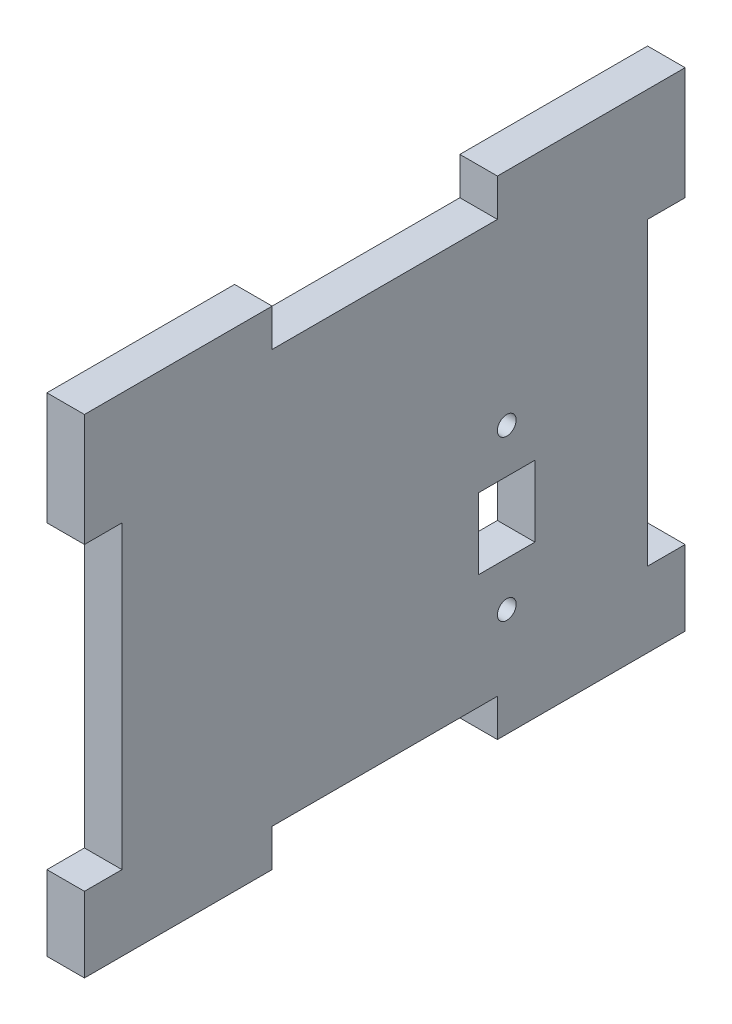
ISO-10303-21;
HEADER;
FILE_DESCRIPTION(('STEP AP214'),'2;1');
FILE_NAME('part.step','',(''),(''),'','','');
FILE_SCHEMA(('AUTOMOTIVE_DESIGN { 1 0 10303 214 1 1 1 1 }'));
ENDSEC;
DATA;
#1=APPLICATION_CONTEXT('core data for automotive mechanical design processes');
#2=APPLICATION_PROTOCOL_DEFINITION('international standard','automotive_design',2000,#1);
#3=PRODUCT_CONTEXT('',#1,'mechanical');
#4=PRODUCT('Part','Part','',(#3));
#5=PRODUCT_RELATED_PRODUCT_CATEGORY('part','',(#4));
#6=PRODUCT_DEFINITION_FORMATION('','',#4);
#7=PRODUCT_DEFINITION_CONTEXT('part definition',#1,'design');
#8=PRODUCT_DEFINITION('design','',#6,#7);
#9=PRODUCT_DEFINITION_SHAPE('','',#8);
#10=(LENGTH_UNIT() NAMED_UNIT(*) SI_UNIT(.MILLI.,.METRE.));
#11=(NAMED_UNIT(*) PLANE_ANGLE_UNIT() SI_UNIT($,.RADIAN.));
#12=(NAMED_UNIT(*) SI_UNIT($,.STERADIAN.) SOLID_ANGLE_UNIT());
#13=UNCERTAINTY_MEASURE_WITH_UNIT(LENGTH_MEASURE(1.E-05),#10,'distance_accuracy_value','');
#14=(GEOMETRIC_REPRESENTATION_CONTEXT(3) GLOBAL_UNCERTAINTY_ASSIGNED_CONTEXT((#13)) GLOBAL_UNIT_ASSIGNED_CONTEXT((#10,
#11,#12)) REPRESENTATION_CONTEXT('',''));
#15=CARTESIAN_POINT('',(0.,0.,0.));
#16=DIRECTION('',(0.,0.,1.));
#17=DIRECTION('',(1.,0.,0.));
#18=AXIS2_PLACEMENT_3D('',#15,#16,#17);
#19=CARTESIAN_POINT('',(6.35,41.275,0.));
#20=DIRECTION('',(0.,1.,0.));
#21=DIRECTION('',(0.,0.,1.));
#22=AXIS2_PLACEMENT_3D('',#19,#20,#21);
#23=PLANE('',#22);
#24=DIRECTION('',(0.,0.,-1.));
#25=VECTOR('',#24,1.);
#26=CARTESIAN_POINT('',(0.,41.275,0.));
#27=LINE('',#26,#25);
#28=CARTESIAN_POINT('',(0.,41.275,-19.05));
#29=VERTEX_POINT('',#28);
#30=CARTESIAN_POINT('',(0.,41.275,-50.8));
#31=VERTEX_POINT('',#30);
#32=EDGE_CURVE('E241',#29,#31,#27,.T.);
#33=ORIENTED_EDGE('',*,*,#32,.F.);
#34=DIRECTION('',(-1.,0.,0.));
#35=VECTOR('',#34,1.);
#36=CARTESIAN_POINT('',(6.35,41.275,-19.05));
#37=LINE('',#36,#35);
#38=CARTESIAN_POINT('',(6.35,41.275,-19.05));
#39=VERTEX_POINT('',#38);
#40=EDGE_CURVE('E11',#39,#29,#37,.T.);
#41=ORIENTED_EDGE('',*,*,#40,.F.);
#42=DIRECTION('',(0.,0.,-1.));
#43=VECTOR('',#42,1.);
#44=CARTESIAN_POINT('',(6.35,41.275,0.));
#45=LINE('',#44,#43);
#46=CARTESIAN_POINT('',(6.35,41.275,-50.8));
#47=VERTEX_POINT('',#46);
#48=EDGE_CURVE('E244',#39,#47,#45,.T.);
#49=ORIENTED_EDGE('',*,*,#48,.T.);
#50=DIRECTION('',(-1.,0.,0.));
#51=VECTOR('',#50,1.);
#52=CARTESIAN_POINT('',(6.35,41.275,-50.8));
#53=LINE('',#52,#51);
#54=EDGE_CURVE('E335',#47,#31,#53,.T.);
#55=ORIENTED_EDGE('',*,*,#54,.T.);
#56=EDGE_LOOP('',(#33,#41,#49,#55));
#57=FACE_BOUND('',#56,.T.);
#58=ADVANCED_FACE('F37',(#57),#23,.T.);
#59=CARTESIAN_POINT('',(6.35,0.,-19.05));
#60=DIRECTION('',(0.,0.,-1.));
#61=DIRECTION('',(-1.,0.,0.));
#62=AXIS2_PLACEMENT_3D('',#59,#60,#61);
#63=PLANE('',#62);
#64=DIRECTION('',(0.,-1.,0.));
#65=VECTOR('',#64,1.);
#66=CARTESIAN_POINT('',(0.,0.,-19.05));
#67=LINE('',#66,#65);
#68=CARTESIAN_POINT('',(0.,34.925,-19.05));
#69=VERTEX_POINT('',#68);
#70=EDGE_CURVE('E291',#29,#69,#67,.T.);
#71=ORIENTED_EDGE('',*,*,#70,.T.);
#72=DIRECTION('',(-1.,0.,0.));
#73=VECTOR('',#72,1.);
#74=CARTESIAN_POINT('',(6.35,34.925,-19.05));
#75=LINE('',#74,#73);
#76=CARTESIAN_POINT('',(6.35,34.925,-19.05));
#77=VERTEX_POINT('',#76);
#78=EDGE_CURVE('E45',#77,#69,#75,.T.);
#79=ORIENTED_EDGE('',*,*,#78,.F.);
#80=DIRECTION('',(0.,-1.,0.));
#81=VECTOR('',#80,1.);
#82=CARTESIAN_POINT('',(6.35,0.,-19.05));
#83=LINE('',#82,#81);
#84=EDGE_CURVE('E247',#39,#77,#83,.T.);
#85=ORIENTED_EDGE('',*,*,#84,.F.);
#86=ORIENTED_EDGE('',*,*,#40,.T.);
#87=EDGE_LOOP('',(#71,#79,#85,#86));
#88=FACE_BOUND('',#87,.T.);
#89=ADVANCED_FACE('F39',(#88),#63,.F.);
#90=CARTESIAN_POINT('',(6.35,34.925,0.));
#91=DIRECTION('',(0.,1.,0.));
#92=DIRECTION('',(0.,0.,1.));
#93=AXIS2_PLACEMENT_3D('',#90,#91,#92);
#94=PLANE('',#93);
#95=DIRECTION('',(0.,0.,-1.));
#96=VECTOR('',#95,1.);
#97=CARTESIAN_POINT('',(0.,34.925,0.));
#98=LINE('',#97,#96);
#99=CARTESIAN_POINT('',(0.,34.925,19.05));
#100=VERTEX_POINT('',#99);
#101=EDGE_CURVE('E295',#100,#69,#98,.T.);
#102=ORIENTED_EDGE('',*,*,#101,.F.);
#103=DIRECTION('',(-1.,0.,0.));
#104=VECTOR('',#103,1.);
#105=CARTESIAN_POINT('',(6.35,34.925,19.05));
#106=LINE('',#105,#104);
#107=CARTESIAN_POINT('',(6.35,34.925,19.05));
#108=VERTEX_POINT('',#107);
#109=EDGE_CURVE('E374',#108,#100,#106,.T.);
#110=ORIENTED_EDGE('',*,*,#109,.F.);
#111=DIRECTION('',(0.,0.,-1.));
#112=VECTOR('',#111,1.);
#113=CARTESIAN_POINT('',(6.35,34.925,0.));
#114=LINE('',#113,#112);
#115=EDGE_CURVE('E251',#108,#77,#114,.T.);
#116=ORIENTED_EDGE('',*,*,#115,.T.);
#117=ORIENTED_EDGE('',*,*,#78,.T.);
#118=EDGE_LOOP('',(#102,#110,#116,#117));
#119=FACE_BOUND('',#118,.T.);
#120=ADVANCED_FACE('F378',(#119),#94,.T.);
#121=CARTESIAN_POINT('',(6.35,0.,19.05));
#122=DIRECTION('',(0.,0.,-1.));
#123=DIRECTION('',(-1.,0.,0.));
#124=AXIS2_PLACEMENT_3D('',#121,#122,#123);
#125=PLANE('',#124);
#126=DIRECTION('',(0.,-1.,0.));
#127=VECTOR('',#126,1.);
#128=CARTESIAN_POINT('',(0.,0.,19.05));
#129=LINE('',#128,#127);
#130=CARTESIAN_POINT('',(0.,41.275,19.05));
#131=VERTEX_POINT('',#130);
#132=EDGE_CURVE('E298',#131,#100,#129,.T.);
#133=ORIENTED_EDGE('',*,*,#132,.F.);
#134=DIRECTION('',(-1.,0.,0.));
#135=VECTOR('',#134,1.);
#136=CARTESIAN_POINT('',(6.35,41.275,19.05));
#137=LINE('',#136,#135);
#138=CARTESIAN_POINT('',(6.35,41.275,19.05));
#139=VERTEX_POINT('',#138);
#140=EDGE_CURVE('E372',#139,#131,#137,.T.);
#141=ORIENTED_EDGE('',*,*,#140,.F.);
#142=DIRECTION('',(0.,-1.,0.));
#143=VECTOR('',#142,1.);
#144=CARTESIAN_POINT('',(6.35,0.,19.05));
#145=LINE('',#144,#143);
#146=EDGE_CURVE('E254',#139,#108,#145,.T.);
#147=ORIENTED_EDGE('',*,*,#146,.T.);
#148=ORIENTED_EDGE('',*,*,#109,.T.);
#149=EDGE_LOOP('',(#133,#141,#147,#148));
#150=FACE_BOUND('',#149,.T.);
#151=ADVANCED_FACE('F389',(#150),#125,.T.);
#152=CARTESIAN_POINT('',(0.,41.275,50.8));
#153=VERTEX_POINT('',#152);
#154=EDGE_CURVE('E292',#153,#131,#27,.T.);
#155=ORIENTED_EDGE('',*,*,#154,.F.);
#156=DIRECTION('',(-1.,0.,0.));
#157=VECTOR('',#156,1.);
#158=CARTESIAN_POINT('',(6.35,41.275,50.8));
#159=LINE('',#158,#157);
#160=CARTESIAN_POINT('',(6.35,41.275,50.8));
#161=VERTEX_POINT('',#160);
#162=EDGE_CURVE('E370',#161,#153,#159,.T.);
#163=ORIENTED_EDGE('',*,*,#162,.F.);
#164=EDGE_CURVE('E249',#161,#139,#45,.T.);
#165=ORIENTED_EDGE('',*,*,#164,.T.);
#166=ORIENTED_EDGE('',*,*,#140,.T.);
#167=EDGE_LOOP('',(#155,#163,#165,#166));
#168=FACE_BOUND('',#167,.T.);
#169=ADVANCED_FACE('F469',(#168),#23,.T.);
#170=CARTESIAN_POINT('',(6.35,0.,50.8));
#171=DIRECTION('',(0.,0.,1.));
#172=DIRECTION('',(1.,0.,0.));
#173=AXIS2_PLACEMENT_3D('',#170,#171,#172);
#174=PLANE('',#173);
#175=DIRECTION('',(0.,1.,0.));
#176=VECTOR('',#175,1.);
#177=CARTESIAN_POINT('',(0.,0.,50.8));
#178=LINE('',#177,#176);
#179=CARTESIAN_POINT('',(0.,22.225,50.8));
#180=VERTEX_POINT('',#179);
#181=EDGE_CURVE('E301',#180,#153,#178,.T.);
#182=ORIENTED_EDGE('',*,*,#181,.F.);
#183=DIRECTION('',(-1.,0.,0.));
#184=VECTOR('',#183,1.);
#185=CARTESIAN_POINT('',(6.35,22.225,50.8));
#186=LINE('',#185,#184);
#187=CARTESIAN_POINT('',(6.35,22.225,50.8));
#188=VERTEX_POINT('',#187);
#189=EDGE_CURVE('E368',#188,#180,#186,.T.);
#190=ORIENTED_EDGE('',*,*,#189,.F.);
#191=DIRECTION('',(0.,1.,0.));
#192=VECTOR('',#191,1.);
#193=CARTESIAN_POINT('',(6.35,0.,50.8));
#194=LINE('',#193,#192);
#195=EDGE_CURVE('E257',#188,#161,#194,.T.);
#196=ORIENTED_EDGE('',*,*,#195,.T.);
#197=ORIENTED_EDGE('',*,*,#162,.T.);
#198=EDGE_LOOP('',(#182,#190,#196,#197));
#199=FACE_BOUND('',#198,.T.);
#200=ADVANCED_FACE('F466',(#199),#174,.T.);
#201=CARTESIAN_POINT('',(6.35,22.225,0.));
#202=DIRECTION('',(0.,1.,0.));
#203=DIRECTION('',(0.,0.,1.));
#204=AXIS2_PLACEMENT_3D('',#201,#202,#203);
#205=PLANE('',#204);
#206=DIRECTION('',(0.,0.,-1.));
#207=VECTOR('',#206,1.);
#208=CARTESIAN_POINT('',(0.,22.225,0.));
#209=LINE('',#208,#207);
#210=CARTESIAN_POINT('',(0.,22.225,44.45));
#211=VERTEX_POINT('',#210);
#212=EDGE_CURVE('E304',#180,#211,#209,.T.);
#213=ORIENTED_EDGE('',*,*,#212,.T.);
#214=DIRECTION('',(-1.,0.,0.));
#215=VECTOR('',#214,1.);
#216=CARTESIAN_POINT('',(6.35,22.225,44.45));
#217=LINE('',#216,#215);
#218=CARTESIAN_POINT('',(6.35,22.225,44.45));
#219=VERTEX_POINT('',#218);
#220=EDGE_CURVE('E366',#219,#211,#217,.T.);
#221=ORIENTED_EDGE('',*,*,#220,.F.);
#222=DIRECTION('',(0.,0.,-1.));
#223=VECTOR('',#222,1.);
#224=CARTESIAN_POINT('',(6.35,22.225,0.));
#225=LINE('',#224,#223);
#226=EDGE_CURVE('E260',#188,#219,#225,.T.);
#227=ORIENTED_EDGE('',*,*,#226,.F.);
#228=ORIENTED_EDGE('',*,*,#189,.T.);
#229=EDGE_LOOP('',(#213,#221,#227,#228));
#230=FACE_BOUND('',#229,.T.);
#231=ADVANCED_FACE('F463',(#230),#205,.F.);
#232=CARTESIAN_POINT('',(6.35,0.,44.45));
#233=DIRECTION('',(0.,0.,1.));
#234=DIRECTION('',(1.,0.,0.));
#235=AXIS2_PLACEMENT_3D('',#232,#233,#234);
#236=PLANE('',#235);
#237=DIRECTION('',(0.,1.,0.));
#238=VECTOR('',#237,1.);
#239=CARTESIAN_POINT('',(0.,0.,44.45));
#240=LINE('',#239,#238);
#241=CARTESIAN_POINT('',(0.,-28.575,44.45));
#242=VERTEX_POINT('',#241);
#243=EDGE_CURVE('E308',#242,#211,#240,.T.);
#244=ORIENTED_EDGE('',*,*,#243,.F.);
#245=DIRECTION('',(-1.,0.,0.));
#246=VECTOR('',#245,1.);
#247=CARTESIAN_POINT('',(6.35,-28.575,44.45));
#248=LINE('',#247,#246);
#249=CARTESIAN_POINT('',(6.35,-28.575,44.45));
#250=VERTEX_POINT('',#249);
#251=EDGE_CURVE('E364',#250,#242,#248,.T.);
#252=ORIENTED_EDGE('',*,*,#251,.F.);
#253=DIRECTION('',(0.,1.,0.));
#254=VECTOR('',#253,1.);
#255=CARTESIAN_POINT('',(6.35,0.,44.45));
#256=LINE('',#255,#254);
#257=EDGE_CURVE('E263',#250,#219,#256,.T.);
#258=ORIENTED_EDGE('',*,*,#257,.T.);
#259=ORIENTED_EDGE('',*,*,#220,.T.);
#260=EDGE_LOOP('',(#244,#252,#258,#259));
#261=FACE_BOUND('',#260,.T.);
#262=ADVANCED_FACE('F459',(#261),#236,.T.);
#263=CARTESIAN_POINT('',(6.35,-28.575,0.));
#264=DIRECTION('',(0.,1.,0.));
#265=DIRECTION('',(0.,0.,1.));
#266=AXIS2_PLACEMENT_3D('',#263,#264,#265);
#267=PLANE('',#266);
#268=DIRECTION('',(0.,0.,-1.));
#269=VECTOR('',#268,1.);
#270=CARTESIAN_POINT('',(0.,-28.575,0.));
#271=LINE('',#270,#269);
#272=CARTESIAN_POINT('',(0.,-28.575,50.8));
#273=VERTEX_POINT('',#272);
#274=EDGE_CURVE('E311',#273,#242,#271,.T.);
#275=ORIENTED_EDGE('',*,*,#274,.F.);
#276=DIRECTION('',(-1.,0.,0.));
#277=VECTOR('',#276,1.);
#278=CARTESIAN_POINT('',(6.35,-28.575,50.8));
#279=LINE('',#278,#277);
#280=CARTESIAN_POINT('',(6.35,-28.575,50.8));
#281=VERTEX_POINT('',#280);
#282=EDGE_CURVE('E362',#281,#273,#279,.T.);
#283=ORIENTED_EDGE('',*,*,#282,.F.);
#284=DIRECTION('',(0.,0.,-1.));
#285=VECTOR('',#284,1.);
#286=CARTESIAN_POINT('',(6.35,-28.575,0.));
#287=LINE('',#286,#285);
#288=EDGE_CURVE('E266',#281,#250,#287,.T.);
#289=ORIENTED_EDGE('',*,*,#288,.T.);
#290=ORIENTED_EDGE('',*,*,#251,.T.);
#291=EDGE_LOOP('',(#275,#283,#289,#290));
#292=FACE_BOUND('',#291,.T.);
#293=ADVANCED_FACE('F455',(#292),#267,.T.);
#294=CARTESIAN_POINT('',(0.,-41.275,50.8));
#295=VERTEX_POINT('',#294);
#296=EDGE_CURVE('E305',#295,#273,#178,.T.);
#297=ORIENTED_EDGE('',*,*,#296,.F.);
#298=DIRECTION('',(-1.,0.,0.));
#299=VECTOR('',#298,1.);
#300=CARTESIAN_POINT('',(6.35,-41.275,50.8));
#301=LINE('',#300,#299);
#302=CARTESIAN_POINT('',(6.35,-41.275,50.8));
#303=VERTEX_POINT('',#302);
#304=EDGE_CURVE('E360',#303,#295,#301,.T.);
#305=ORIENTED_EDGE('',*,*,#304,.F.);
#306=EDGE_CURVE('E261',#303,#281,#194,.T.);
#307=ORIENTED_EDGE('',*,*,#306,.T.);
#308=ORIENTED_EDGE('',*,*,#282,.T.);
#309=EDGE_LOOP('',(#297,#305,#307,#308));
#310=FACE_BOUND('',#309,.T.);
#311=ADVANCED_FACE('F450',(#310),#174,.T.);
#312=CARTESIAN_POINT('',(6.35,-41.275,0.));
#313=DIRECTION('',(0.,1.,0.));
#314=DIRECTION('',(0.,0.,1.));
#315=AXIS2_PLACEMENT_3D('',#312,#313,#314);
#316=PLANE('',#315);
#317=DIRECTION('',(0.,0.,-1.));
#318=VECTOR('',#317,1.);
#319=CARTESIAN_POINT('',(0.,-41.275,0.));
#320=LINE('',#319,#318);
#321=CARTESIAN_POINT('',(0.,-41.275,19.05));
#322=VERTEX_POINT('',#321);
#323=EDGE_CURVE('E314',#295,#322,#320,.T.);
#324=ORIENTED_EDGE('',*,*,#323,.T.);
#325=DIRECTION('',(-1.,0.,0.));
#326=VECTOR('',#325,1.);
#327=CARTESIAN_POINT('',(6.35,-41.275,19.05));
#328=LINE('',#327,#326);
#329=CARTESIAN_POINT('',(6.35,-41.275,19.05));
#330=VERTEX_POINT('',#329);
#331=EDGE_CURVE('E357',#330,#322,#328,.T.);
#332=ORIENTED_EDGE('',*,*,#331,.F.);
#333=DIRECTION('',(0.,0.,-1.));
#334=VECTOR('',#333,1.);
#335=CARTESIAN_POINT('',(6.35,-41.275,0.));
#336=LINE('',#335,#334);
#337=EDGE_CURVE('E269',#303,#330,#336,.T.);
#338=ORIENTED_EDGE('',*,*,#337,.F.);
#339=ORIENTED_EDGE('',*,*,#304,.T.);
#340=EDGE_LOOP('',(#324,#332,#338,#339));
#341=FACE_BOUND('',#340,.T.);
#342=ADVANCED_FACE('F446',(#341),#316,.F.);
#343=CARTESIAN_POINT('',(6.35,0.,19.05));
#344=DIRECTION('',(0.,0.,1.));
#345=DIRECTION('',(1.,0.,0.));
#346=AXIS2_PLACEMENT_3D('',#343,#344,#345);
#347=PLANE('',#346);
#348=DIRECTION('',(0.,1.,0.));
#349=VECTOR('',#348,1.);
#350=CARTESIAN_POINT('',(0.,0.,19.05));
#351=LINE('',#350,#349);
#352=CARTESIAN_POINT('',(0.,-34.925,19.05));
#353=VERTEX_POINT('',#352);
#354=EDGE_CURVE('E316',#322,#353,#351,.T.);
#355=ORIENTED_EDGE('',*,*,#354,.T.);
#356=DIRECTION('',(-1.,0.,0.));
#357=VECTOR('',#356,1.);
#358=CARTESIAN_POINT('',(6.35,-34.925,19.05));
#359=LINE('',#358,#357);
#360=CARTESIAN_POINT('',(6.35,-34.925,19.05));
#361=VERTEX_POINT('',#360);
#362=EDGE_CURVE('E354',#361,#353,#359,.T.);
#363=ORIENTED_EDGE('',*,*,#362,.F.);
#364=DIRECTION('',(0.,1.,0.));
#365=VECTOR('',#364,1.);
#366=CARTESIAN_POINT('',(6.35,0.,19.05));
#367=LINE('',#366,#365);
#368=EDGE_CURVE('E271',#330,#361,#367,.T.);
#369=ORIENTED_EDGE('',*,*,#368,.F.);
#370=ORIENTED_EDGE('',*,*,#331,.T.);
#371=EDGE_LOOP('',(#355,#363,#369,#370));
#372=FACE_BOUND('',#371,.T.);
#373=ADVANCED_FACE('F441',(#372),#347,.F.);
#374=CARTESIAN_POINT('',(6.35,-34.925,0.));
#375=DIRECTION('',(0.,1.,0.));
#376=DIRECTION('',(0.,0.,1.));
#377=AXIS2_PLACEMENT_3D('',#374,#375,#376);
#378=PLANE('',#377);
#379=DIRECTION('',(0.,0.,-1.));
#380=VECTOR('',#379,1.);
#381=CARTESIAN_POINT('',(0.,-34.925,0.));
#382=LINE('',#381,#380);
#383=CARTESIAN_POINT('',(0.,-34.925,-19.05));
#384=VERTEX_POINT('',#383);
#385=EDGE_CURVE('E319',#353,#384,#382,.T.);
#386=ORIENTED_EDGE('',*,*,#385,.T.);
#387=DIRECTION('',(-1.,0.,0.));
#388=VECTOR('',#387,1.);
#389=CARTESIAN_POINT('',(6.35,-34.925,-19.05));
#390=LINE('',#389,#388);
#391=CARTESIAN_POINT('',(6.35,-34.925,-19.05));
#392=VERTEX_POINT('',#391);
#393=EDGE_CURVE('E352',#392,#384,#390,.T.);
#394=ORIENTED_EDGE('',*,*,#393,.F.);
#395=DIRECTION('',(0.,0.,-1.));
#396=VECTOR('',#395,1.);
#397=CARTESIAN_POINT('',(6.35,-34.925,0.));
#398=LINE('',#397,#396);
#399=EDGE_CURVE('E274',#361,#392,#398,.T.);
#400=ORIENTED_EDGE('',*,*,#399,.F.);
#401=ORIENTED_EDGE('',*,*,#362,.T.);
#402=EDGE_LOOP('',(#386,#394,#400,#401));
#403=FACE_BOUND('',#402,.T.);
#404=ADVANCED_FACE('F434',(#403),#378,.F.);
#405=CARTESIAN_POINT('',(6.35,0.,-19.05));
#406=DIRECTION('',(0.,0.,1.));
#407=DIRECTION('',(1.,0.,0.));
#408=AXIS2_PLACEMENT_3D('',#405,#406,#407);
#409=PLANE('',#408);
#410=DIRECTION('',(0.,1.,0.));
#411=VECTOR('',#410,1.);
#412=CARTESIAN_POINT('',(0.,0.,-19.05));
#413=LINE('',#412,#411);
#414=CARTESIAN_POINT('',(0.,-41.275,-19.05));
#415=VERTEX_POINT('',#414);
#416=EDGE_CURVE('E322',#415,#384,#413,.T.);
#417=ORIENTED_EDGE('',*,*,#416,.F.);
#418=DIRECTION('',(-1.,0.,0.));
#419=VECTOR('',#418,1.);
#420=CARTESIAN_POINT('',(6.35,-41.275,-19.05));
#421=LINE('',#420,#419);
#422=CARTESIAN_POINT('',(6.35,-41.275,-19.05));
#423=VERTEX_POINT('',#422);
#424=EDGE_CURVE('E350',#423,#415,#421,.T.);
#425=ORIENTED_EDGE('',*,*,#424,.F.);
#426=DIRECTION('',(0.,1.,0.));
#427=VECTOR('',#426,1.);
#428=CARTESIAN_POINT('',(6.35,0.,-19.05));
#429=LINE('',#428,#427);
#430=EDGE_CURVE('E276',#423,#392,#429,.T.);
#431=ORIENTED_EDGE('',*,*,#430,.T.);
#432=ORIENTED_EDGE('',*,*,#393,.T.);
#433=EDGE_LOOP('',(#417,#425,#431,#432));
#434=FACE_BOUND('',#433,.T.);
#435=ADVANCED_FACE('F430',(#434),#409,.T.);
#436=CARTESIAN_POINT('',(0.,-41.275,-50.8));
#437=VERTEX_POINT('',#436);
#438=EDGE_CURVE('E317',#415,#437,#320,.T.);
#439=ORIENTED_EDGE('',*,*,#438,.T.);
#440=DIRECTION('',(-1.,0.,0.));
#441=VECTOR('',#440,1.);
#442=CARTESIAN_POINT('',(6.35,-41.275,-50.8));
#443=LINE('',#442,#441);
#444=CARTESIAN_POINT('',(6.35,-41.275,-50.8));
#445=VERTEX_POINT('',#444);
#446=EDGE_CURVE('E347',#445,#437,#443,.T.);
#447=ORIENTED_EDGE('',*,*,#446,.F.);
#448=EDGE_CURVE('E272',#423,#445,#336,.T.);
#449=ORIENTED_EDGE('',*,*,#448,.F.);
#450=ORIENTED_EDGE('',*,*,#424,.T.);
#451=EDGE_LOOP('',(#439,#447,#449,#450));
#452=FACE_BOUND('',#451,.T.);
#453=ADVANCED_FACE('F425',(#452),#316,.F.);
#454=CARTESIAN_POINT('',(6.35,0.,-50.8));
#455=DIRECTION('',(0.,0.,1.));
#456=DIRECTION('',(1.,0.,0.));
#457=AXIS2_PLACEMENT_3D('',#454,#455,#456);
#458=PLANE('',#457);
#459=DIRECTION('',(0.,1.,0.));
#460=VECTOR('',#459,1.);
#461=CARTESIAN_POINT('',(0.,0.,-50.8));
#462=LINE('',#461,#460);
#463=CARTESIAN_POINT('',(0.,-28.575,-50.8));
#464=VERTEX_POINT('',#463);
#465=EDGE_CURVE('E325',#437,#464,#462,.T.);
#466=ORIENTED_EDGE('',*,*,#465,.T.);
#467=DIRECTION('',(-1.,0.,0.));
#468=VECTOR('',#467,1.);
#469=CARTESIAN_POINT('',(6.35,-28.575,-50.8));
#470=LINE('',#469,#468);
#471=CARTESIAN_POINT('',(6.35,-28.575,-50.8));
#472=VERTEX_POINT('',#471);
#473=EDGE_CURVE('E344',#472,#464,#470,.T.);
#474=ORIENTED_EDGE('',*,*,#473,.F.);
#475=DIRECTION('',(0.,1.,0.));
#476=VECTOR('',#475,1.);
#477=CARTESIAN_POINT('',(6.35,0.,-50.8));
#478=LINE('',#477,#476);
#479=EDGE_CURVE('E279',#445,#472,#478,.T.);
#480=ORIENTED_EDGE('',*,*,#479,.F.);
#481=ORIENTED_EDGE('',*,*,#446,.T.);
#482=EDGE_LOOP('',(#466,#474,#480,#481));
#483=FACE_BOUND('',#482,.T.);
#484=ADVANCED_FACE('F421',(#483),#458,.F.);
#485=CARTESIAN_POINT('',(6.35,-28.575,0.));
#486=DIRECTION('',(0.,-1.,0.));
#487=DIRECTION('',(0.,0.,-1.));
#488=AXIS2_PLACEMENT_3D('',#485,#486,#487);
#489=PLANE('',#488);
#490=DIRECTION('',(0.,0.,1.));
#491=VECTOR('',#490,1.);
#492=CARTESIAN_POINT('',(0.,-28.575,0.));
#493=LINE('',#492,#491);
#494=CARTESIAN_POINT('',(0.,-28.575,-44.45));
#495=VERTEX_POINT('',#494);
#496=EDGE_CURVE('E327',#464,#495,#493,.T.);
#497=ORIENTED_EDGE('',*,*,#496,.T.);
#498=DIRECTION('',(-1.,0.,0.));
#499=VECTOR('',#498,1.);
#500=CARTESIAN_POINT('',(6.35,-28.575,-44.45));
#501=LINE('',#500,#499);
#502=CARTESIAN_POINT('',(6.35,-28.575,-44.45));
#503=VERTEX_POINT('',#502);
#504=EDGE_CURVE('E341',#503,#495,#501,.T.);
#505=ORIENTED_EDGE('',*,*,#504,.F.);
#506=DIRECTION('',(0.,0.,1.));
#507=VECTOR('',#506,1.);
#508=CARTESIAN_POINT('',(6.35,-28.575,0.));
#509=LINE('',#508,#507);
#510=EDGE_CURVE('E281',#472,#503,#509,.T.);
#511=ORIENTED_EDGE('',*,*,#510,.F.);
#512=ORIENTED_EDGE('',*,*,#473,.T.);
#513=EDGE_LOOP('',(#497,#505,#511,#512));
#514=FACE_BOUND('',#513,.T.);
#515=ADVANCED_FACE('F416',(#514),#489,.F.);
#516=CARTESIAN_POINT('',(6.35,0.,-44.45));
#517=DIRECTION('',(0.,0.,1.));
#518=DIRECTION('',(1.,0.,0.));
#519=AXIS2_PLACEMENT_3D('',#516,#517,#518);
#520=PLANE('',#519);
#521=DIRECTION('',(0.,1.,0.));
#522=VECTOR('',#521,1.);
#523=CARTESIAN_POINT('',(0.,0.,-44.45));
#524=LINE('',#523,#522);
#525=CARTESIAN_POINT('',(0.,22.225,-44.45));
#526=VERTEX_POINT('',#525);
#527=EDGE_CURVE('E329',#495,#526,#524,.T.);
#528=ORIENTED_EDGE('',*,*,#527,.T.);
#529=DIRECTION('',(-1.,0.,0.));
#530=VECTOR('',#529,1.);
#531=CARTESIAN_POINT('',(6.35,22.225,-44.45));
#532=LINE('',#531,#530);
#533=CARTESIAN_POINT('',(6.35,22.225,-44.45));
#534=VERTEX_POINT('',#533);
#535=EDGE_CURVE('E339',#534,#526,#532,.T.);
#536=ORIENTED_EDGE('',*,*,#535,.F.);
#537=DIRECTION('',(0.,1.,0.));
#538=VECTOR('',#537,1.);
#539=CARTESIAN_POINT('',(6.35,0.,-44.45));
#540=LINE('',#539,#538);
#541=EDGE_CURVE('E284',#503,#534,#540,.T.);
#542=ORIENTED_EDGE('',*,*,#541,.F.);
#543=ORIENTED_EDGE('',*,*,#504,.T.);
#544=EDGE_LOOP('',(#528,#536,#542,#543));
#545=FACE_BOUND('',#544,.T.);
#546=ADVANCED_FACE('F410',(#545),#520,.F.);
#547=CARTESIAN_POINT('',(6.35,22.225,0.));
#548=DIRECTION('',(0.,-1.,0.));
#549=DIRECTION('',(0.,0.,-1.));
#550=AXIS2_PLACEMENT_3D('',#547,#548,#549);
#551=PLANE('',#550);
#552=DIRECTION('',(0.,0.,1.));
#553=VECTOR('',#552,1.);
#554=CARTESIAN_POINT('',(0.,22.225,0.));
#555=LINE('',#554,#553);
#556=CARTESIAN_POINT('',(0.,22.225,-50.8));
#557=VERTEX_POINT('',#556);
#558=EDGE_CURVE('E332',#557,#526,#555,.T.);
#559=ORIENTED_EDGE('',*,*,#558,.F.);
#560=DIRECTION('',(-1.,0.,0.));
#561=VECTOR('',#560,1.);
#562=CARTESIAN_POINT('',(6.35,22.225,-50.8));
#563=LINE('',#562,#561);
#564=CARTESIAN_POINT('',(6.35,22.225,-50.8));
#565=VERTEX_POINT('',#564);
#566=EDGE_CURVE('E337',#565,#557,#563,.T.);
#567=ORIENTED_EDGE('',*,*,#566,.F.);
#568=DIRECTION('',(0.,0.,1.));
#569=VECTOR('',#568,1.);
#570=CARTESIAN_POINT('',(6.35,22.225,0.));
#571=LINE('',#570,#569);
#572=EDGE_CURVE('E286',#565,#534,#571,.T.);
#573=ORIENTED_EDGE('',*,*,#572,.T.);
#574=ORIENTED_EDGE('',*,*,#535,.T.);
#575=EDGE_LOOP('',(#559,#567,#573,#574));
#576=FACE_BOUND('',#575,.T.);
#577=ADVANCED_FACE('F406',(#576),#551,.T.);
#578=EDGE_CURVE('E248',#557,#31,#462,.T.);
#579=ORIENTED_EDGE('',*,*,#578,.T.);
#580=ORIENTED_EDGE('',*,*,#54,.F.);
#581=EDGE_CURVE('E282',#565,#47,#478,.T.);
#582=ORIENTED_EDGE('',*,*,#581,.F.);
#583=ORIENTED_EDGE('',*,*,#566,.T.);
#584=EDGE_LOOP('',(#579,#580,#582,#583));
#585=FACE_BOUND('',#584,.T.);
#586=ADVANCED_FACE('F581',(#585),#458,.F.);
#587=CARTESIAN_POINT('',(6.35,0.,0.));
#588=DIRECTION('',(1.,0.,0.));
#589=DIRECTION('',(0.,0.,-1.));
#590=AXIS2_PLACEMENT_3D('',#587,#588,#589);
#591=PLANE('',#590);
#592=CARTESIAN_POINT('',(6.34999999999999,3.96875000000059,-20.6375000000003));
#593=DIRECTION('',(1.,0.,0.));
#594=DIRECTION('',(0.,0.,-1.));
#595=AXIS2_PLACEMENT_3D('',#592,#593,#594);
#596=CIRCLE('',#595,1.58749999999999);
#597=CARTESIAN_POINT('',(6.34999999999999,3.96875000000059,-22.2250000000003));
#598=VERTEX_POINT('',#597);
#599=EDGE_CURVE('E221',#598,#598,#596,.T.);
#600=ORIENTED_EDGE('',*,*,#599,.F.);
#601=EDGE_LOOP('',(#600));
#602=FACE_BOUND('',#601,.T.);
#603=DIRECTION('',(0.,1.,0.));
#604=VECTOR('',#603,1.);
#605=CARTESIAN_POINT('',(6.34999999999999,-3.52424999999938,-25.4000000000003));
#606=LINE('',#605,#604);
#607=CARTESIAN_POINT('',(6.34999999999999,-15.5257499999994,-25.4000000000004));
#608=VERTEX_POINT('',#607);
#609=CARTESIAN_POINT('',(6.35,-3.52424999999938,-25.4000000000003));
#610=VERTEX_POINT('',#609);
#611=EDGE_CURVE('E52',#608,#610,#606,.T.);
#612=ORIENTED_EDGE('',*,*,#611,.F.);
#613=DIRECTION('',(0.,0.,-1.));
#614=VECTOR('',#613,1.);
#615=CARTESIAN_POINT('',(6.34999999999999,-15.5257499999994,-15.8750000000004));
#616=LINE('',#615,#614);
#617=CARTESIAN_POINT('',(6.34999999999999,-15.5257499999994,-15.8750000000004));
#618=VERTEX_POINT('',#617);
#619=EDGE_CURVE('E215',#618,#608,#616,.T.);
#620=ORIENTED_EDGE('',*,*,#619,.F.);
#621=DIRECTION('',(0.,-1.,0.));
#622=VECTOR('',#621,1.);
#623=CARTESIAN_POINT('',(6.34999999999999,-3.52424999999942,-15.8750000000003));
#624=LINE('',#623,#622);
#625=CARTESIAN_POINT('',(6.34999999999999,-3.52424999999942,-15.8750000000003));
#626=VERTEX_POINT('',#625);
#627=EDGE_CURVE('E218',#626,#618,#624,.T.);
#628=ORIENTED_EDGE('',*,*,#627,.F.);
#629=DIRECTION('',(0.,0.,1.));
#630=VECTOR('',#629,1.);
#631=CARTESIAN_POINT('',(6.34999999999999,-3.52424999999942,-15.8750000000003));
#632=LINE('',#631,#630);
#633=EDGE_CURVE('E227',#610,#626,#632,.T.);
#634=ORIENTED_EDGE('',*,*,#633,.F.);
#635=EDGE_LOOP('',(#612,#620,#628,#634));
#636=FACE_BOUND('',#635,.T.);
#637=CARTESIAN_POINT('',(6.34999999999999,-23.0187499999994,-20.6375000000004));
#638=DIRECTION('',(1.,0.,0.));
#639=DIRECTION('',(0.,0.,-1.));
#640=AXIS2_PLACEMENT_3D('',#637,#638,#639);
#641=CIRCLE('',#640,1.5875);
#642=CARTESIAN_POINT('',(6.34999999999999,-23.0187499999994,-22.2250000000004));
#643=VERTEX_POINT('',#642);
#644=EDGE_CURVE('E234',#643,#643,#641,.T.);
#645=ORIENTED_EDGE('',*,*,#644,.F.);
#646=EDGE_LOOP('',(#645));
#647=FACE_BOUND('',#646,.T.);
#648=ORIENTED_EDGE('',*,*,#48,.F.);
#649=ORIENTED_EDGE('',*,*,#84,.T.);
#650=ORIENTED_EDGE('',*,*,#115,.F.);
#651=ORIENTED_EDGE('',*,*,#146,.F.);
#652=ORIENTED_EDGE('',*,*,#164,.F.);
#653=ORIENTED_EDGE('',*,*,#195,.F.);
#654=ORIENTED_EDGE('',*,*,#226,.T.);
#655=ORIENTED_EDGE('',*,*,#257,.F.);
#656=ORIENTED_EDGE('',*,*,#288,.F.);
#657=ORIENTED_EDGE('',*,*,#306,.F.);
#658=ORIENTED_EDGE('',*,*,#337,.T.);
#659=ORIENTED_EDGE('',*,*,#368,.T.);
#660=ORIENTED_EDGE('',*,*,#399,.T.);
#661=ORIENTED_EDGE('',*,*,#430,.F.);
#662=ORIENTED_EDGE('',*,*,#448,.T.);
#663=ORIENTED_EDGE('',*,*,#479,.T.);
#664=ORIENTED_EDGE('',*,*,#510,.T.);
#665=ORIENTED_EDGE('',*,*,#541,.T.);
#666=ORIENTED_EDGE('',*,*,#572,.F.);
#667=ORIENTED_EDGE('',*,*,#581,.T.);
#668=EDGE_LOOP('',(#648,#649,#650,#651,#652,#653,#654,#655,#656,#657,#658,#659,#660,#661,#662,
#663,#664,#665,#666,#667));
#669=FACE_BOUND('',#668,.T.);
#670=ADVANCED_FACE('F393',(#602,#636,#647,#669),#591,.T.);
#671=CARTESIAN_POINT('',(0.,0.,0.));
#672=DIRECTION('',(1.,0.,0.));
#673=DIRECTION('',(0.,0.,-1.));
#674=AXIS2_PLACEMENT_3D('',#671,#672,#673);
#675=PLANE('',#674);
#676=CARTESIAN_POINT('',(0.,3.96875000000059,-20.6375000000003));
#677=DIRECTION('',(1.,0.,0.));
#678=DIRECTION('',(0.,0.,-1.));
#679=AXIS2_PLACEMENT_3D('',#676,#677,#678);
#680=CIRCLE('',#679,1.58749999999999);
#681=CARTESIAN_POINT('',(0.,3.96875000000059,-22.2250000000003));
#682=VERTEX_POINT('',#681);
#683=EDGE_CURVE('E228',#682,#682,#680,.T.);
#684=ORIENTED_EDGE('',*,*,#683,.T.);
#685=EDGE_LOOP('',(#684));
#686=FACE_BOUND('',#685,.T.);
#687=DIRECTION('',(0.,0.,-1.));
#688=VECTOR('',#687,1.);
#689=CARTESIAN_POINT('',(0.,-15.5257499999994,-15.8750000000004));
#690=LINE('',#689,#688);
#691=CARTESIAN_POINT('',(0.,-15.5257499999994,-15.8750000000004));
#692=VERTEX_POINT('',#691);
#693=CARTESIAN_POINT('',(0.,-15.5257499999994,-25.4000000000004));
#694=VERTEX_POINT('',#693);
#695=EDGE_CURVE('E205',#692,#694,#690,.T.);
#696=ORIENTED_EDGE('',*,*,#695,.T.);
#697=DIRECTION('',(0.,1.,0.));
#698=VECTOR('',#697,1.);
#699=CARTESIAN_POINT('',(0.,-3.52424999999938,-25.4000000000003));
#700=LINE('',#699,#698);
#701=CARTESIAN_POINT('',(0.,-3.52424999999938,-25.4000000000003));
#702=VERTEX_POINT('',#701);
#703=EDGE_CURVE('E199',#694,#702,#700,.T.);
#704=ORIENTED_EDGE('',*,*,#703,.T.);
#705=DIRECTION('',(0.,0.,1.));
#706=VECTOR('',#705,1.);
#707=CARTESIAN_POINT('',(0.,-3.52424999999942,-15.8750000000003));
#708=LINE('',#707,#706);
#709=CARTESIAN_POINT('',(0.,-3.52424999999942,-15.8750000000003));
#710=VERTEX_POINT('',#709);
#711=EDGE_CURVE('E208',#702,#710,#708,.T.);
#712=ORIENTED_EDGE('',*,*,#711,.T.);
#713=DIRECTION('',(0.,-1.,0.));
#714=VECTOR('',#713,1.);
#715=CARTESIAN_POINT('',(0.,-3.52424999999942,-15.8750000000003));
#716=LINE('',#715,#714);
#717=EDGE_CURVE('E60',#710,#692,#716,.T.);
#718=ORIENTED_EDGE('',*,*,#717,.T.);
#719=EDGE_LOOP('',(#696,#704,#712,#718));
#720=FACE_BOUND('',#719,.T.);
#721=CARTESIAN_POINT('',(0.,-23.0187499999994,-20.6375000000004));
#722=DIRECTION('',(1.,0.,0.));
#723=DIRECTION('',(0.,0.,-1.));
#724=AXIS2_PLACEMENT_3D('',#721,#722,#723);
#725=CIRCLE('',#724,1.5875);
#726=CARTESIAN_POINT('',(0.,-23.0187499999994,-22.2250000000004));
#727=VERTEX_POINT('',#726);
#728=EDGE_CURVE('E238',#727,#727,#725,.T.);
#729=ORIENTED_EDGE('',*,*,#728,.T.);
#730=EDGE_LOOP('',(#729));
#731=FACE_BOUND('',#730,.T.);
#732=ORIENTED_EDGE('',*,*,#32,.T.);
#733=ORIENTED_EDGE('',*,*,#578,.F.);
#734=ORIENTED_EDGE('',*,*,#558,.T.);
#735=ORIENTED_EDGE('',*,*,#527,.F.);
#736=ORIENTED_EDGE('',*,*,#496,.F.);
#737=ORIENTED_EDGE('',*,*,#465,.F.);
#738=ORIENTED_EDGE('',*,*,#438,.F.);
#739=ORIENTED_EDGE('',*,*,#416,.T.);
#740=ORIENTED_EDGE('',*,*,#385,.F.);
#741=ORIENTED_EDGE('',*,*,#354,.F.);
#742=ORIENTED_EDGE('',*,*,#323,.F.);
#743=ORIENTED_EDGE('',*,*,#296,.T.);
#744=ORIENTED_EDGE('',*,*,#274,.T.);
#745=ORIENTED_EDGE('',*,*,#243,.T.);
#746=ORIENTED_EDGE('',*,*,#212,.F.);
#747=ORIENTED_EDGE('',*,*,#181,.T.);
#748=ORIENTED_EDGE('',*,*,#154,.T.);
#749=ORIENTED_EDGE('',*,*,#132,.T.);
#750=ORIENTED_EDGE('',*,*,#101,.T.);
#751=ORIENTED_EDGE('',*,*,#70,.F.);
#752=EDGE_LOOP('',(#732,#733,#734,#735,#736,#737,#738,#739,#740,#741,#742,#743,#744,#745,#746,
#747,#748,#749,#750,#751));
#753=FACE_BOUND('',#752,.T.);
#754=ADVANCED_FACE('F212',(#686,#720,#731,#753),#675,.F.);
#755=CARTESIAN_POINT('',(0.,-23.0187499999994,-20.6375000000004));
#756=DIRECTION('',(1.,0.,0.));
#757=DIRECTION('',(0.,0.,-1.));
#758=AXIS2_PLACEMENT_3D('',#755,#756,#757);
#759=CYLINDRICAL_SURFACE('',#758,1.5875);
#760=ORIENTED_EDGE('',*,*,#728,.F.);
#761=EDGE_LOOP('',(#760));
#762=FACE_BOUND('',#761,.T.);
#763=ORIENTED_EDGE('',*,*,#644,.T.);
#764=EDGE_LOOP('',(#763));
#765=FACE_BOUND('',#764,.T.);
#766=ADVANCED_FACE('F626',(#762,#765),#759,.F.);
#767=CARTESIAN_POINT('',(0.,-3.52424999999938,-25.4000000000003));
#768=DIRECTION('',(0.,0.,-1.));
#769=DIRECTION('',(0.,1.,0.));
#770=AXIS2_PLACEMENT_3D('',#767,#768,#769);
#771=PLANE('',#770);
#772=ORIENTED_EDGE('',*,*,#611,.T.);
#773=DIRECTION('',(1.,0.,0.));
#774=VECTOR('',#773,1.);
#775=CARTESIAN_POINT('',(0.,-3.52424999999938,-25.4000000000003));
#776=LINE('',#775,#774);
#777=EDGE_CURVE('E195',#702,#610,#776,.T.);
#778=ORIENTED_EDGE('',*,*,#777,.F.);
#779=ORIENTED_EDGE('',*,*,#703,.F.);
#780=DIRECTION('',(1.,0.,0.));
#781=VECTOR('',#780,1.);
#782=CARTESIAN_POINT('',(0.,-15.5257499999994,-25.4000000000004));
#783=LINE('',#782,#781);
#784=EDGE_CURVE('E232',#694,#608,#783,.T.);
#785=ORIENTED_EDGE('',*,*,#784,.T.);
#786=EDGE_LOOP('',(#772,#778,#779,#785));
#787=FACE_BOUND('',#786,.T.);
#788=ADVANCED_FACE('F197',(#787),#771,.F.);
#789=CARTESIAN_POINT('',(0.,-15.5257499999994,-15.8750000000004));
#790=DIRECTION('',(0.,-1.,0.));
#791=DIRECTION('',(0.,0.,-1.));
#792=AXIS2_PLACEMENT_3D('',#789,#790,#791);
#793=PLANE('',#792);
#794=ORIENTED_EDGE('',*,*,#619,.T.);
#795=ORIENTED_EDGE('',*,*,#784,.F.);
#796=ORIENTED_EDGE('',*,*,#695,.F.);
#797=DIRECTION('',(1.,0.,0.));
#798=VECTOR('',#797,1.);
#799=CARTESIAN_POINT('',(0.,-15.5257499999994,-15.8750000000004));
#800=LINE('',#799,#798);
#801=EDGE_CURVE('E235',#692,#618,#800,.T.);
#802=ORIENTED_EDGE('',*,*,#801,.T.);
#803=EDGE_LOOP('',(#794,#795,#796,#802));
#804=FACE_BOUND('',#803,.T.);
#805=ADVANCED_FACE('F644',(#804),#793,.F.);
#806=CARTESIAN_POINT('',(0.,-3.52424999999942,-15.8750000000003));
#807=DIRECTION('',(0.,0.,1.));
#808=DIRECTION('',(0.,-1.,0.));
#809=AXIS2_PLACEMENT_3D('',#806,#807,#808);
#810=PLANE('',#809);
#811=ORIENTED_EDGE('',*,*,#627,.T.);
#812=ORIENTED_EDGE('',*,*,#801,.F.);
#813=ORIENTED_EDGE('',*,*,#717,.F.);
#814=DIRECTION('',(1.,0.,0.));
#815=VECTOR('',#814,1.);
#816=CARTESIAN_POINT('',(0.,-3.52424999999942,-15.8750000000003));
#817=LINE('',#816,#815);
#818=EDGE_CURVE('E204',#710,#626,#817,.T.);
#819=ORIENTED_EDGE('',*,*,#818,.T.);
#820=EDGE_LOOP('',(#811,#812,#813,#819));
#821=FACE_BOUND('',#820,.T.);
#822=ADVANCED_FACE('F653',(#821),#810,.F.);
#823=CARTESIAN_POINT('',(0.,-3.52424999999942,-15.8750000000003));
#824=DIRECTION('',(0.,1.,0.));
#825=DIRECTION('',(0.,0.,1.));
#826=AXIS2_PLACEMENT_3D('',#823,#824,#825);
#827=PLANE('',#826);
#828=ORIENTED_EDGE('',*,*,#633,.T.);
#829=ORIENTED_EDGE('',*,*,#818,.F.);
#830=ORIENTED_EDGE('',*,*,#711,.F.);
#831=ORIENTED_EDGE('',*,*,#777,.T.);
#832=EDGE_LOOP('',(#828,#829,#830,#831));
#833=FACE_BOUND('',#832,.T.);
#834=ADVANCED_FACE('F209',(#833),#827,.F.);
#835=CARTESIAN_POINT('',(0.,3.96875000000059,-20.6375000000003));
#836=DIRECTION('',(1.,0.,0.));
#837=DIRECTION('',(0.,0.,-1.));
#838=AXIS2_PLACEMENT_3D('',#835,#836,#837);
#839=CYLINDRICAL_SURFACE('',#838,1.58749999999999);
#840=ORIENTED_EDGE('',*,*,#683,.F.);
#841=EDGE_LOOP('',(#840));
#842=FACE_BOUND('',#841,.T.);
#843=ORIENTED_EDGE('',*,*,#599,.T.);
#844=EDGE_LOOP('',(#843));
#845=FACE_BOUND('',#844,.T.);
#846=ADVANCED_FACE('F671',(#842,#845),#839,.F.);
#847=CLOSED_SHELL('',(#58,#89,#120,#151,#169,#200,#231,#262,#293,#311,#342,#373,#404,#435,#453,
#484,#515,#546,#577,#586,#670,#754,#766,#788,#805,#822,#834,#846));
#848=MANIFOLD_SOLID_BREP('B2',#847);
#849=ADVANCED_BREP_SHAPE_REPRESENTATION('',(#18,#848),#14);
#850=SHAPE_DEFINITION_REPRESENTATION(#9,#849);
ENDSEC;
END-ISO-10303-21;
